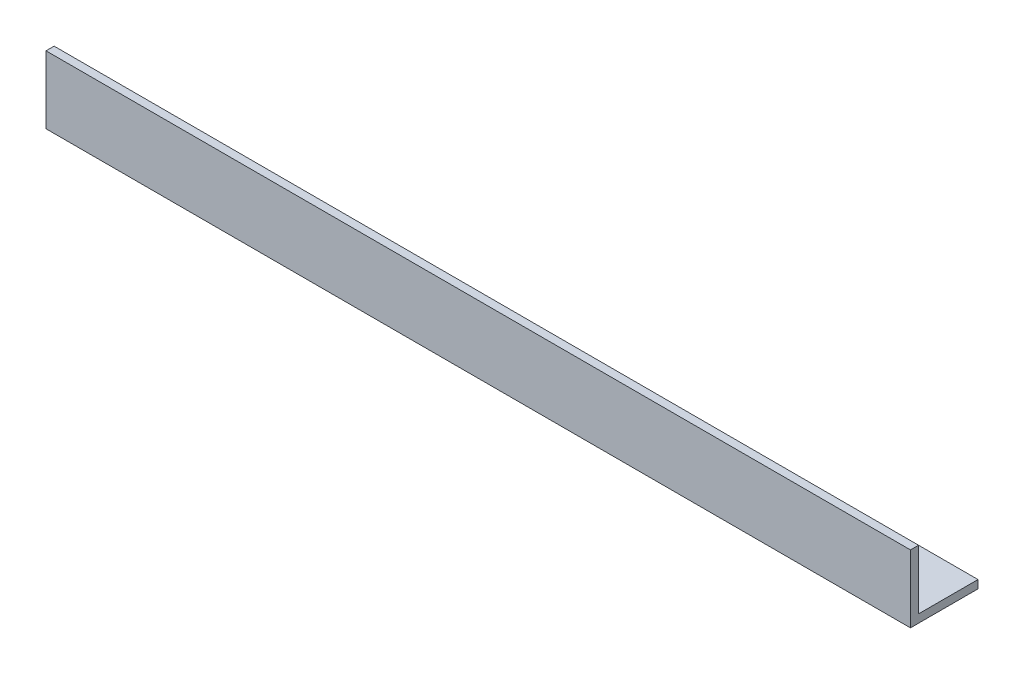
ISO-10303-21;
HEADER;
FILE_DESCRIPTION(('STEP AP214'),'2;1');
FILE_NAME('part.step','',(''),(''),'','','');
FILE_SCHEMA(('AUTOMOTIVE_DESIGN { 1 0 10303 214 1 1 1 1 }'));
ENDSEC;
DATA;
#1=APPLICATION_CONTEXT('core data for automotive mechanical design processes');
#2=APPLICATION_PROTOCOL_DEFINITION('international standard','automotive_design',2000,#1);
#3=PRODUCT_CONTEXT('',#1,'mechanical');
#4=PRODUCT('Part','Part','',(#3));
#5=PRODUCT_RELATED_PRODUCT_CATEGORY('part','',(#4));
#6=PRODUCT_DEFINITION_FORMATION('','',#4);
#7=PRODUCT_DEFINITION_CONTEXT('part definition',#1,'design');
#8=PRODUCT_DEFINITION('design','',#6,#7);
#9=PRODUCT_DEFINITION_SHAPE('','',#8);
#10=(LENGTH_UNIT() NAMED_UNIT(*) SI_UNIT(.MILLI.,.METRE.));
#11=(NAMED_UNIT(*) PLANE_ANGLE_UNIT() SI_UNIT($,.RADIAN.));
#12=(NAMED_UNIT(*) SI_UNIT($,.STERADIAN.) SOLID_ANGLE_UNIT());
#13=UNCERTAINTY_MEASURE_WITH_UNIT(LENGTH_MEASURE(1.E-05),#10,'distance_accuracy_value','');
#14=(GEOMETRIC_REPRESENTATION_CONTEXT(3) GLOBAL_UNCERTAINTY_ASSIGNED_CONTEXT((#13)) GLOBAL_UNIT_ASSIGNED_CONTEXT((#10,
#11,#12)) REPRESENTATION_CONTEXT('',''));
#15=CARTESIAN_POINT('',(0.,0.,0.));
#16=DIRECTION('',(0.,0.,1.));
#17=DIRECTION('',(1.,0.,0.));
#18=AXIS2_PLACEMENT_3D('',#15,#16,#17);
#19=CARTESIAN_POINT('',(320.,0.,0.));
#20=DIRECTION('',(0.,1.,0.));
#21=DIRECTION('',(0.,0.,1.));
#22=AXIS2_PLACEMENT_3D('',#19,#20,#21);
#23=PLANE('',#22);
#24=DIRECTION('',(0.,0.,-1.));
#25=VECTOR('',#24,1.);
#26=CARTESIAN_POINT('',(0.,0.,0.));
#27=LINE('',#26,#25);
#28=CARTESIAN_POINT('',(0.,0.,0.));
#29=VERTEX_POINT('',#28);
#30=CARTESIAN_POINT('',(0.,0.,-25.));
#31=VERTEX_POINT('',#30);
#32=EDGE_CURVE('E118',#29,#31,#27,.T.);
#33=ORIENTED_EDGE('',*,*,#32,.T.);
#34=DIRECTION('',(-1.,0.,0.));
#35=VECTOR('',#34,1.);
#36=CARTESIAN_POINT('',(320.,0.,-25.));
#37=LINE('',#36,#35);
#38=CARTESIAN_POINT('',(320.,0.,-25.));
#39=VERTEX_POINT('',#38);
#40=EDGE_CURVE('E11',#39,#31,#37,.T.);
#41=ORIENTED_EDGE('',*,*,#40,.F.);
#42=DIRECTION('',(0.,0.,-1.));
#43=VECTOR('',#42,1.);
#44=CARTESIAN_POINT('',(320.,0.,0.));
#45=LINE('',#44,#43);
#46=CARTESIAN_POINT('',(320.,0.,0.));
#47=VERTEX_POINT('',#46);
#48=EDGE_CURVE('E83',#47,#39,#45,.T.);
#49=ORIENTED_EDGE('',*,*,#48,.F.);
#50=DIRECTION('',(-1.,0.,0.));
#51=VECTOR('',#50,1.);
#52=CARTESIAN_POINT('',(320.,0.,0.));
#53=LINE('',#52,#51);
#54=EDGE_CURVE('E114',#47,#29,#53,.T.);
#55=ORIENTED_EDGE('',*,*,#54,.T.);
#56=EDGE_LOOP('',(#33,#41,#49,#55));
#57=FACE_BOUND('',#56,.T.);
#58=ADVANCED_FACE('F37',(#57),#23,.F.);
#59=CARTESIAN_POINT('',(320.,3.,-25.));
#60=DIRECTION('',(0.,0.,-1.));
#61=DIRECTION('',(-1.,0.,0.));
#62=AXIS2_PLACEMENT_3D('',#59,#60,#61);
#63=PLANE('',#62);
#64=DIRECTION('',(0.,-1.,0.));
#65=VECTOR('',#64,1.);
#66=CARTESIAN_POINT('',(0.,3.,-25.));
#67=LINE('',#66,#65);
#68=CARTESIAN_POINT('',(0.,3.,-25.));
#69=VERTEX_POINT('',#68);
#70=EDGE_CURVE('E121',#69,#31,#67,.T.);
#71=ORIENTED_EDGE('',*,*,#70,.F.);
#72=DIRECTION('',(-1.,0.,0.));
#73=VECTOR('',#72,1.);
#74=CARTESIAN_POINT('',(320.,3.,-25.));
#75=LINE('',#74,#73);
#76=CARTESIAN_POINT('',(320.,3.,-25.));
#77=VERTEX_POINT('',#76);
#78=EDGE_CURVE('E45',#77,#69,#75,.T.);
#79=ORIENTED_EDGE('',*,*,#78,.F.);
#80=DIRECTION('',(0.,-1.,0.));
#81=VECTOR('',#80,1.);
#82=CARTESIAN_POINT('',(320.,3.,-25.));
#83=LINE('',#82,#81);
#84=EDGE_CURVE('E223',#77,#39,#83,.T.);
#85=ORIENTED_EDGE('',*,*,#84,.T.);
#86=ORIENTED_EDGE('',*,*,#40,.T.);
#87=EDGE_LOOP('',(#71,#79,#85,#86));
#88=FACE_BOUND('',#87,.T.);
#89=ADVANCED_FACE('F139',(#88),#63,.T.);
#90=CARTESIAN_POINT('',(320.,3.,0.));
#91=DIRECTION('',(0.,1.,0.));
#92=DIRECTION('',(0.,0.,1.));
#93=AXIS2_PLACEMENT_3D('',#90,#91,#92);
#94=PLANE('',#93);
#95=DIRECTION('',(0.,0.,-1.));
#96=VECTOR('',#95,1.);
#97=CARTESIAN_POINT('',(0.,3.,0.));
#98=LINE('',#97,#96);
#99=CARTESIAN_POINT('',(0.,3.,-3.));
#100=VERTEX_POINT('',#99);
#101=EDGE_CURVE('E124',#100,#69,#98,.T.);
#102=ORIENTED_EDGE('',*,*,#101,.F.);
#103=DIRECTION('',(-1.,0.,0.));
#104=VECTOR('',#103,1.);
#105=CARTESIAN_POINT('',(320.,3.,-3.));
#106=LINE('',#105,#104);
#107=CARTESIAN_POINT('',(320.,3.,-3.));
#108=VERTEX_POINT('',#107);
#109=EDGE_CURVE('E104',#108,#100,#106,.T.);
#110=ORIENTED_EDGE('',*,*,#109,.F.);
#111=DIRECTION('',(0.,0.,-1.));
#112=VECTOR('',#111,1.);
#113=CARTESIAN_POINT('',(320.,3.,0.));
#114=LINE('',#113,#112);
#115=EDGE_CURVE('E110',#108,#77,#114,.T.);
#116=ORIENTED_EDGE('',*,*,#115,.T.);
#117=ORIENTED_EDGE('',*,*,#78,.T.);
#118=EDGE_LOOP('',(#102,#110,#116,#117));
#119=FACE_BOUND('',#118,.T.);
#120=ADVANCED_FACE('F136',(#119),#94,.T.);
#121=CARTESIAN_POINT('',(320.,25.,-3.));
#122=DIRECTION('',(0.,0.,-1.));
#123=DIRECTION('',(0.,1.,0.));
#124=AXIS2_PLACEMENT_3D('',#121,#122,#123);
#125=PLANE('',#124);
#126=DIRECTION('',(0.,-1.,0.));
#127=VECTOR('',#126,1.);
#128=CARTESIAN_POINT('',(0.,25.,-3.));
#129=LINE('',#128,#127);
#130=CARTESIAN_POINT('',(0.,25.,-3.));
#131=VERTEX_POINT('',#130);
#132=EDGE_CURVE('E99',#131,#100,#129,.T.);
#133=ORIENTED_EDGE('',*,*,#132,.F.);
#134=DIRECTION('',(-1.,0.,0.));
#135=VECTOR('',#134,1.);
#136=CARTESIAN_POINT('',(320.,25.,-3.));
#137=LINE('',#136,#135);
#138=CARTESIAN_POINT('',(320.,25.,-3.));
#139=VERTEX_POINT('',#138);
#140=EDGE_CURVE('E94',#139,#131,#137,.T.);
#141=ORIENTED_EDGE('',*,*,#140,.F.);
#142=DIRECTION('',(0.,-1.,0.));
#143=VECTOR('',#142,1.);
#144=CARTESIAN_POINT('',(320.,25.,-3.));
#145=LINE('',#144,#143);
#146=EDGE_CURVE('E97',#139,#108,#145,.T.);
#147=ORIENTED_EDGE('',*,*,#146,.T.);
#148=ORIENTED_EDGE('',*,*,#109,.T.);
#149=EDGE_LOOP('',(#133,#141,#147,#148));
#150=FACE_BOUND('',#149,.T.);
#151=ADVANCED_FACE('F96',(#150),#125,.T.);
#152=CARTESIAN_POINT('',(320.,25.,0.));
#153=DIRECTION('',(0.,1.,0.));
#154=DIRECTION('',(0.,0.,1.));
#155=AXIS2_PLACEMENT_3D('',#152,#153,#154);
#156=PLANE('',#155);
#157=DIRECTION('',(0.,0.,-1.));
#158=VECTOR('',#157,1.);
#159=CARTESIAN_POINT('',(0.,25.,0.));
#160=LINE('',#159,#158);
#161=CARTESIAN_POINT('',(0.,25.,0.));
#162=VERTEX_POINT('',#161);
#163=EDGE_CURVE('E128',#162,#131,#160,.T.);
#164=ORIENTED_EDGE('',*,*,#163,.F.);
#165=DIRECTION('',(-1.,0.,0.));
#166=VECTOR('',#165,1.);
#167=CARTESIAN_POINT('',(320.,25.,0.));
#168=LINE('',#167,#166);
#169=CARTESIAN_POINT('',(320.,25.,0.));
#170=VERTEX_POINT('',#169);
#171=EDGE_CURVE('E74',#170,#162,#168,.T.);
#172=ORIENTED_EDGE('',*,*,#171,.F.);
#173=DIRECTION('',(0.,0.,-1.));
#174=VECTOR('',#173,1.);
#175=CARTESIAN_POINT('',(320.,25.,0.));
#176=LINE('',#175,#174);
#177=EDGE_CURVE('E108',#170,#139,#176,.T.);
#178=ORIENTED_EDGE('',*,*,#177,.T.);
#179=ORIENTED_EDGE('',*,*,#140,.T.);
#180=EDGE_LOOP('',(#164,#172,#178,#179));
#181=FACE_BOUND('',#180,.T.);
#182=ADVANCED_FACE('F112',(#181),#156,.T.);
#183=CARTESIAN_POINT('',(320.,25.,0.));
#184=DIRECTION('',(0.,0.,-1.));
#185=DIRECTION('',(0.,1.,0.));
#186=AXIS2_PLACEMENT_3D('',#183,#184,#185);
#187=PLANE('',#186);
#188=DIRECTION('',(0.,-1.,0.));
#189=VECTOR('',#188,1.);
#190=CARTESIAN_POINT('',(0.,25.,0.));
#191=LINE('',#190,#189);
#192=EDGE_CURVE('E77',#162,#29,#191,.T.);
#193=ORIENTED_EDGE('',*,*,#192,.T.);
#194=ORIENTED_EDGE('',*,*,#54,.F.);
#195=DIRECTION('',(0.,-1.,0.));
#196=VECTOR('',#195,1.);
#197=CARTESIAN_POINT('',(320.,25.,0.));
#198=LINE('',#197,#196);
#199=EDGE_CURVE('E53',#170,#47,#198,.T.);
#200=ORIENTED_EDGE('',*,*,#199,.F.);
#201=ORIENTED_EDGE('',*,*,#171,.T.);
#202=EDGE_LOOP('',(#193,#194,#200,#201));
#203=FACE_BOUND('',#202,.T.);
#204=ADVANCED_FACE('F144',(#203),#187,.F.);
#205=CARTESIAN_POINT('',(320.,0.,0.));
#206=DIRECTION('',(-1.,0.,0.));
#207=DIRECTION('',(0.,0.,1.));
#208=AXIS2_PLACEMENT_3D('',#205,#206,#207);
#209=PLANE('',#208);
#210=ORIENTED_EDGE('',*,*,#48,.T.);
#211=ORIENTED_EDGE('',*,*,#84,.F.);
#212=ORIENTED_EDGE('',*,*,#115,.F.);
#213=ORIENTED_EDGE('',*,*,#146,.F.);
#214=ORIENTED_EDGE('',*,*,#177,.F.);
#215=ORIENTED_EDGE('',*,*,#199,.T.);
#216=EDGE_LOOP('',(#210,#211,#212,#213,#214,#215));
#217=FACE_BOUND('',#216,.T.);
#218=ADVANCED_FACE('F107',(#217),#209,.F.);
#219=CARTESIAN_POINT('',(0.,0.,0.));
#220=DIRECTION('',(-1.,0.,0.));
#221=DIRECTION('',(0.,0.,1.));
#222=AXIS2_PLACEMENT_3D('',#219,#220,#221);
#223=PLANE('',#222);
#224=ORIENTED_EDGE('',*,*,#32,.F.);
#225=ORIENTED_EDGE('',*,*,#192,.F.);
#226=ORIENTED_EDGE('',*,*,#163,.T.);
#227=ORIENTED_EDGE('',*,*,#132,.T.);
#228=ORIENTED_EDGE('',*,*,#101,.T.);
#229=ORIENTED_EDGE('',*,*,#70,.T.);
#230=EDGE_LOOP('',(#224,#225,#226,#227,#228,#229));
#231=FACE_BOUND('',#230,.T.);
#232=ADVANCED_FACE('F142',(#231),#223,.T.);
#233=CLOSED_SHELL('',(#58,#89,#120,#151,#182,#204,#218,#232));
#234=MANIFOLD_SOLID_BREP('B2',#233);
#235=ADVANCED_BREP_SHAPE_REPRESENTATION('',(#18,#234),#14);
#236=SHAPE_DEFINITION_REPRESENTATION(#9,#235);
ENDSEC;
END-ISO-10303-21;
